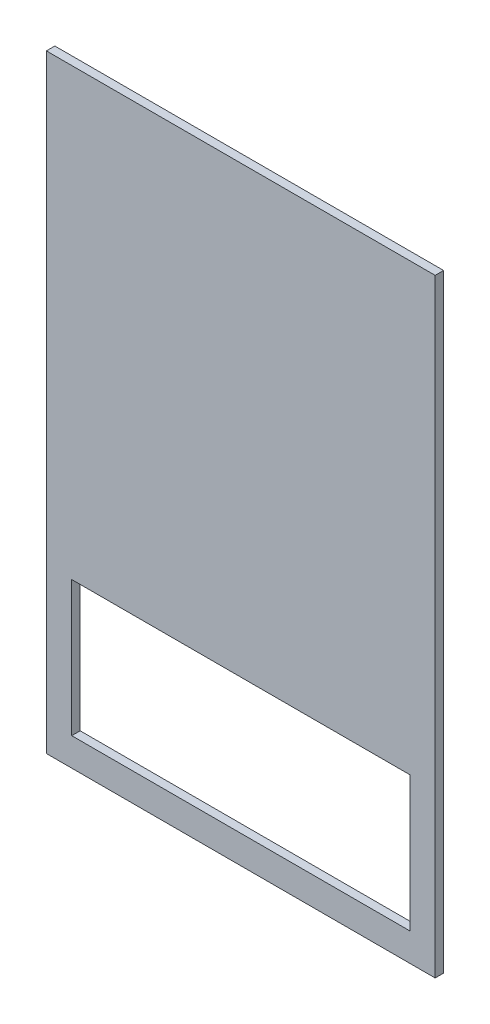
ISO-10303-21;
HEADER;
FILE_DESCRIPTION(('STEP AP214'),'2;1');
FILE_NAME('part.step','',(''),(''),'','','');
FILE_SCHEMA(('AUTOMOTIVE_DESIGN { 1 0 10303 214 1 1 1 1 }'));
ENDSEC;
DATA;
#1=APPLICATION_CONTEXT('core data for automotive mechanical design processes');
#2=APPLICATION_PROTOCOL_DEFINITION('international standard','automotive_design',2000,#1);
#3=PRODUCT_CONTEXT('',#1,'mechanical');
#4=PRODUCT('Part','Part','',(#3));
#5=PRODUCT_RELATED_PRODUCT_CATEGORY('part','',(#4));
#6=PRODUCT_DEFINITION_FORMATION('','',#4);
#7=PRODUCT_DEFINITION_CONTEXT('part definition',#1,'design');
#8=PRODUCT_DEFINITION('design','',#6,#7);
#9=PRODUCT_DEFINITION_SHAPE('','',#8);
#10=(LENGTH_UNIT() NAMED_UNIT(*) SI_UNIT(.MILLI.,.METRE.));
#11=(NAMED_UNIT(*) PLANE_ANGLE_UNIT() SI_UNIT($,.RADIAN.));
#12=(NAMED_UNIT(*) SI_UNIT($,.STERADIAN.) SOLID_ANGLE_UNIT());
#13=UNCERTAINTY_MEASURE_WITH_UNIT(LENGTH_MEASURE(1.E-05),#10,'distance_accuracy_value','');
#14=(GEOMETRIC_REPRESENTATION_CONTEXT(3) GLOBAL_UNCERTAINTY_ASSIGNED_CONTEXT((#13)) GLOBAL_UNIT_ASSIGNED_CONTEXT((#10,
#11,#12)) REPRESENTATION_CONTEXT('',''));
#15=CARTESIAN_POINT('',(0.,0.,0.));
#16=DIRECTION('',(0.,0.,1.));
#17=DIRECTION('',(1.,0.,0.));
#18=AXIS2_PLACEMENT_3D('',#15,#16,#17);
#19=CARTESIAN_POINT('',(292.1,-457.2,12.7));
#20=DIRECTION('',(-1.,0.,0.));
#21=DIRECTION('',(0.,0.,1.));
#22=AXIS2_PLACEMENT_3D('',#19,#20,#21);
#23=PLANE('',#22);
#24=DIRECTION('',(0.,1.,0.));
#25=VECTOR('',#24,1.);
#26=CARTESIAN_POINT('',(292.1,-457.2,0.));
#27=LINE('',#26,#25);
#28=CARTESIAN_POINT('',(292.1,-457.2,0.));
#29=VERTEX_POINT('',#28);
#30=CARTESIAN_POINT('',(292.1,457.2,0.));
#31=VERTEX_POINT('',#30);
#32=EDGE_CURVE('E129',#29,#31,#27,.T.);
#33=ORIENTED_EDGE('',*,*,#32,.T.);
#34=DIRECTION('',(0.,0.,-1.));
#35=VECTOR('',#34,1.);
#36=CARTESIAN_POINT('',(292.1,457.2,12.7));
#37=LINE('',#36,#35);
#38=CARTESIAN_POINT('',(292.1,457.2,12.7));
#39=VERTEX_POINT('',#38);
#40=EDGE_CURVE('E11',#39,#31,#37,.T.);
#41=ORIENTED_EDGE('',*,*,#40,.F.);
#42=DIRECTION('',(0.,1.,0.));
#43=VECTOR('',#42,1.);
#44=CARTESIAN_POINT('',(292.1,-457.2,12.7));
#45=LINE('',#44,#43);
#46=CARTESIAN_POINT('',(292.1,-457.2,12.7));
#47=VERTEX_POINT('',#46);
#48=EDGE_CURVE('E133',#47,#39,#45,.T.);
#49=ORIENTED_EDGE('',*,*,#48,.F.);
#50=DIRECTION('',(0.,0.,-1.));
#51=VECTOR('',#50,1.);
#52=CARTESIAN_POINT('',(292.1,-457.2,12.7));
#53=LINE('',#52,#51);
#54=EDGE_CURVE('E143',#47,#29,#53,.T.);
#55=ORIENTED_EDGE('',*,*,#54,.T.);
#56=EDGE_LOOP('',(#33,#41,#49,#55));
#57=FACE_BOUND('',#56,.T.);
#58=ADVANCED_FACE('F32',(#57),#23,.F.);
#59=CARTESIAN_POINT('',(-292.1,457.2,12.7));
#60=DIRECTION('',(0.,-1.,0.));
#61=DIRECTION('',(0.,0.,-1.));
#62=AXIS2_PLACEMENT_3D('',#59,#60,#61);
#63=PLANE('',#62);
#64=DIRECTION('',(-1.,0.,0.));
#65=VECTOR('',#64,1.);
#66=CARTESIAN_POINT('',(-292.1,457.2,0.));
#67=LINE('',#66,#65);
#68=CARTESIAN_POINT('',(-292.1,457.2,0.));
#69=VERTEX_POINT('',#68);
#70=EDGE_CURVE('E146',#31,#69,#67,.T.);
#71=ORIENTED_EDGE('',*,*,#70,.T.);
#72=DIRECTION('',(0.,0.,-1.));
#73=VECTOR('',#72,1.);
#74=CARTESIAN_POINT('',(-292.1,457.2,12.7));
#75=LINE('',#74,#73);
#76=CARTESIAN_POINT('',(-292.1,457.2,12.7));
#77=VERTEX_POINT('',#76);
#78=EDGE_CURVE('E39',#77,#69,#75,.T.);
#79=ORIENTED_EDGE('',*,*,#78,.F.);
#80=DIRECTION('',(-1.,0.,0.));
#81=VECTOR('',#80,1.);
#82=CARTESIAN_POINT('',(-292.1,457.2,12.7));
#83=LINE('',#82,#81);
#84=EDGE_CURVE('E136',#39,#77,#83,.T.);
#85=ORIENTED_EDGE('',*,*,#84,.F.);
#86=ORIENTED_EDGE('',*,*,#40,.T.);
#87=EDGE_LOOP('',(#71,#79,#85,#86));
#88=FACE_BOUND('',#87,.T.);
#89=ADVANCED_FACE('F174',(#88),#63,.F.);
#90=CARTESIAN_POINT('',(-292.1,-457.2,12.7));
#91=DIRECTION('',(1.,0.,0.));
#92=DIRECTION('',(0.,0.,-1.));
#93=AXIS2_PLACEMENT_3D('',#90,#91,#92);
#94=PLANE('',#93);
#95=DIRECTION('',(0.,-1.,0.));
#96=VECTOR('',#95,1.);
#97=CARTESIAN_POINT('',(-292.1,-457.2,0.));
#98=LINE('',#97,#96);
#99=CARTESIAN_POINT('',(-292.1,-457.2,0.));
#100=VERTEX_POINT('',#99);
#101=EDGE_CURVE('E148',#69,#100,#98,.T.);
#102=ORIENTED_EDGE('',*,*,#101,.T.);
#103=DIRECTION('',(0.,0.,-1.));
#104=VECTOR('',#103,1.);
#105=CARTESIAN_POINT('',(-292.1,-457.2,12.7));
#106=LINE('',#105,#104);
#107=CARTESIAN_POINT('',(-292.1,-457.2,12.7));
#108=VERTEX_POINT('',#107);
#109=EDGE_CURVE('E153',#108,#100,#106,.T.);
#110=ORIENTED_EDGE('',*,*,#109,.F.);
#111=DIRECTION('',(0.,-1.,0.));
#112=VECTOR('',#111,1.);
#113=CARTESIAN_POINT('',(-292.1,-457.2,12.7));
#114=LINE('',#113,#112);
#115=EDGE_CURVE('E139',#77,#108,#114,.T.);
#116=ORIENTED_EDGE('',*,*,#115,.F.);
#117=ORIENTED_EDGE('',*,*,#78,.T.);
#118=EDGE_LOOP('',(#102,#110,#116,#117));
#119=FACE_BOUND('',#118,.T.);
#120=ADVANCED_FACE('F160',(#119),#94,.F.);
#121=CARTESIAN_POINT('',(-292.1,-457.2,12.7));
#122=DIRECTION('',(0.,1.,0.));
#123=DIRECTION('',(0.,0.,1.));
#124=AXIS2_PLACEMENT_3D('',#121,#122,#123);
#125=PLANE('',#124);
#126=DIRECTION('',(1.,0.,0.));
#127=VECTOR('',#126,1.);
#128=CARTESIAN_POINT('',(-292.1,-457.2,0.));
#129=LINE('',#128,#127);
#130=EDGE_CURVE('E137',#100,#29,#129,.T.);
#131=ORIENTED_EDGE('',*,*,#130,.T.);
#132=ORIENTED_EDGE('',*,*,#54,.F.);
#133=DIRECTION('',(1.,0.,0.));
#134=VECTOR('',#133,1.);
#135=CARTESIAN_POINT('',(-292.1,-457.2,12.7));
#136=LINE('',#135,#134);
#137=EDGE_CURVE('E141',#108,#47,#136,.T.);
#138=ORIENTED_EDGE('',*,*,#137,.F.);
#139=ORIENTED_EDGE('',*,*,#109,.T.);
#140=EDGE_LOOP('',(#131,#132,#138,#139));
#141=FACE_BOUND('',#140,.T.);
#142=ADVANCED_FACE('F167',(#141),#125,.F.);
#143=CARTESIAN_POINT('',(0.,0.,12.7));
#144=DIRECTION('',(0.,0.,-1.));
#145=DIRECTION('',(-1.,0.,0.));
#146=AXIS2_PLACEMENT_3D('',#143,#144,#145);
#147=PLANE('',#146);
#148=DIRECTION('',(1.,0.,0.));
#149=VECTOR('',#148,1.);
#150=CARTESIAN_POINT('',(254.,-414.909,12.7));
#151=LINE('',#150,#149);
#152=CARTESIAN_POINT('',(-254.,-414.909,12.7));
#153=VERTEX_POINT('',#152);
#154=CARTESIAN_POINT('',(254.,-414.909,12.7));
#155=VERTEX_POINT('',#154);
#156=EDGE_CURVE('E123',#153,#155,#151,.T.);
#157=ORIENTED_EDGE('',*,*,#156,.F.);
#158=DIRECTION('',(0.,-1.,0.));
#159=VECTOR('',#158,1.);
#160=CARTESIAN_POINT('',(-254.,-211.709,12.7));
#161=LINE('',#160,#159);
#162=CARTESIAN_POINT('',(-254.,-211.709,12.7));
#163=VERTEX_POINT('',#162);
#164=EDGE_CURVE('E46',#163,#153,#161,.T.);
#165=ORIENTED_EDGE('',*,*,#164,.F.);
#166=DIRECTION('',(-1.,0.,0.));
#167=VECTOR('',#166,1.);
#168=CARTESIAN_POINT('',(254.,-211.709,12.7));
#169=LINE('',#168,#167);
#170=CARTESIAN_POINT('',(254.,-211.709,12.7));
#171=VERTEX_POINT('',#170);
#172=EDGE_CURVE('E114',#171,#163,#169,.T.);
#173=ORIENTED_EDGE('',*,*,#172,.F.);
#174=DIRECTION('',(0.,1.,0.));
#175=VECTOR('',#174,1.);
#176=CARTESIAN_POINT('',(254.,-211.709,12.7));
#177=LINE('',#176,#175);
#178=EDGE_CURVE('E117',#155,#171,#177,.T.);
#179=ORIENTED_EDGE('',*,*,#178,.F.);
#180=EDGE_LOOP('',(#157,#165,#173,#179));
#181=FACE_BOUND('',#180,.T.);
#182=ORIENTED_EDGE('',*,*,#48,.T.);
#183=ORIENTED_EDGE('',*,*,#84,.T.);
#184=ORIENTED_EDGE('',*,*,#115,.T.);
#185=ORIENTED_EDGE('',*,*,#137,.T.);
#186=EDGE_LOOP('',(#182,#183,#184,#185));
#187=FACE_BOUND('',#186,.T.);
#188=ADVANCED_FACE('F173',(#181,#187),#147,.F.);
#189=CARTESIAN_POINT('',(0.,0.,0.));
#190=DIRECTION('',(0.,0.,-1.));
#191=DIRECTION('',(-1.,0.,0.));
#192=AXIS2_PLACEMENT_3D('',#189,#190,#191);
#193=PLANE('',#192);
#194=DIRECTION('',(0.,-1.,0.));
#195=VECTOR('',#194,1.);
#196=CARTESIAN_POINT('',(-254.,-211.709,0.));
#197=LINE('',#196,#195);
#198=CARTESIAN_POINT('',(-254.,-211.709,0.));
#199=VERTEX_POINT('',#198);
#200=CARTESIAN_POINT('',(-254.,-414.909,0.));
#201=VERTEX_POINT('',#200);
#202=EDGE_CURVE('E98',#199,#201,#197,.T.);
#203=ORIENTED_EDGE('',*,*,#202,.T.);
#204=DIRECTION('',(1.,0.,0.));
#205=VECTOR('',#204,1.);
#206=CARTESIAN_POINT('',(254.,-414.909,0.));
#207=LINE('',#206,#205);
#208=CARTESIAN_POINT('',(254.,-414.909,0.));
#209=VERTEX_POINT('',#208);
#210=EDGE_CURVE('E107',#201,#209,#207,.T.);
#211=ORIENTED_EDGE('',*,*,#210,.T.);
#212=DIRECTION('',(0.,1.,0.));
#213=VECTOR('',#212,1.);
#214=CARTESIAN_POINT('',(254.,-211.709,0.));
#215=LINE('',#214,#213);
#216=CARTESIAN_POINT('',(254.,-211.709,0.));
#217=VERTEX_POINT('',#216);
#218=EDGE_CURVE('E54',#209,#217,#215,.T.);
#219=ORIENTED_EDGE('',*,*,#218,.T.);
#220=DIRECTION('',(-1.,0.,0.));
#221=VECTOR('',#220,1.);
#222=CARTESIAN_POINT('',(254.,-211.709,0.));
#223=LINE('',#222,#221);
#224=EDGE_CURVE('E104',#217,#199,#223,.T.);
#225=ORIENTED_EDGE('',*,*,#224,.T.);
#226=EDGE_LOOP('',(#203,#211,#219,#225));
#227=FACE_BOUND('',#226,.T.);
#228=ORIENTED_EDGE('',*,*,#32,.F.);
#229=ORIENTED_EDGE('',*,*,#130,.F.);
#230=ORIENTED_EDGE('',*,*,#101,.F.);
#231=ORIENTED_EDGE('',*,*,#70,.F.);
#232=EDGE_LOOP('',(#228,#229,#230,#231));
#233=FACE_BOUND('',#232,.T.);
#234=ADVANCED_FACE('F111',(#227,#233),#193,.T.);
#235=CARTESIAN_POINT('',(-254.,-211.709,0.));
#236=DIRECTION('',(-1.,0.,0.));
#237=DIRECTION('',(0.,0.,1.));
#238=AXIS2_PLACEMENT_3D('',#235,#236,#237);
#239=PLANE('',#238);
#240=ORIENTED_EDGE('',*,*,#164,.T.);
#241=DIRECTION('',(0.,0.,1.));
#242=VECTOR('',#241,1.);
#243=CARTESIAN_POINT('',(-254.,-414.909,0.));
#244=LINE('',#243,#242);
#245=EDGE_CURVE('E94',#201,#153,#244,.T.);
#246=ORIENTED_EDGE('',*,*,#245,.F.);
#247=ORIENTED_EDGE('',*,*,#202,.F.);
#248=DIRECTION('',(0.,0.,1.));
#249=VECTOR('',#248,1.);
#250=CARTESIAN_POINT('',(-254.,-211.709,0.));
#251=LINE('',#250,#249);
#252=EDGE_CURVE('E127',#199,#163,#251,.T.);
#253=ORIENTED_EDGE('',*,*,#252,.T.);
#254=EDGE_LOOP('',(#240,#246,#247,#253));
#255=FACE_BOUND('',#254,.T.);
#256=ADVANCED_FACE('F96',(#255),#239,.F.);
#257=CARTESIAN_POINT('',(254.,-211.709,0.));
#258=DIRECTION('',(0.,1.,0.));
#259=DIRECTION('',(0.,0.,1.));
#260=AXIS2_PLACEMENT_3D('',#257,#258,#259);
#261=PLANE('',#260);
#262=ORIENTED_EDGE('',*,*,#172,.T.);
#263=ORIENTED_EDGE('',*,*,#252,.F.);
#264=ORIENTED_EDGE('',*,*,#224,.F.);
#265=DIRECTION('',(0.,0.,1.));
#266=VECTOR('',#265,1.);
#267=CARTESIAN_POINT('',(254.,-211.709,0.));
#268=LINE('',#267,#266);
#269=EDGE_CURVE('E130',#217,#171,#268,.T.);
#270=ORIENTED_EDGE('',*,*,#269,.T.);
#271=EDGE_LOOP('',(#262,#263,#264,#270));
#272=FACE_BOUND('',#271,.T.);
#273=ADVANCED_FACE('F191',(#272),#261,.F.);
#274=CARTESIAN_POINT('',(254.,-211.709,0.));
#275=DIRECTION('',(1.,0.,0.));
#276=DIRECTION('',(0.,0.,-1.));
#277=AXIS2_PLACEMENT_3D('',#274,#275,#276);
#278=PLANE('',#277);
#279=ORIENTED_EDGE('',*,*,#178,.T.);
#280=ORIENTED_EDGE('',*,*,#269,.F.);
#281=ORIENTED_EDGE('',*,*,#218,.F.);
#282=DIRECTION('',(0.,0.,1.));
#283=VECTOR('',#282,1.);
#284=CARTESIAN_POINT('',(254.,-414.909,0.));
#285=LINE('',#284,#283);
#286=EDGE_CURVE('E103',#209,#155,#285,.T.);
#287=ORIENTED_EDGE('',*,*,#286,.T.);
#288=EDGE_LOOP('',(#279,#280,#281,#287));
#289=FACE_BOUND('',#288,.T.);
#290=ADVANCED_FACE('F194',(#289),#278,.F.);
#291=CARTESIAN_POINT('',(254.,-414.909,0.));
#292=DIRECTION('',(0.,-1.,0.));
#293=DIRECTION('',(0.,0.,-1.));
#294=AXIS2_PLACEMENT_3D('',#291,#292,#293);
#295=PLANE('',#294);
#296=ORIENTED_EDGE('',*,*,#156,.T.);
#297=ORIENTED_EDGE('',*,*,#286,.F.);
#298=ORIENTED_EDGE('',*,*,#210,.F.);
#299=ORIENTED_EDGE('',*,*,#245,.T.);
#300=EDGE_LOOP('',(#296,#297,#298,#299));
#301=FACE_BOUND('',#300,.T.);
#302=ADVANCED_FACE('F108',(#301),#295,.F.);
#303=CLOSED_SHELL('',(#58,#89,#120,#142,#188,#234,#256,#273,#290,#302));
#304=MANIFOLD_SOLID_BREP('B2',#303);
#305=ADVANCED_BREP_SHAPE_REPRESENTATION('',(#18,#304),#14);
#306=SHAPE_DEFINITION_REPRESENTATION(#9,#305);
ENDSEC;
END-ISO-10303-21;
